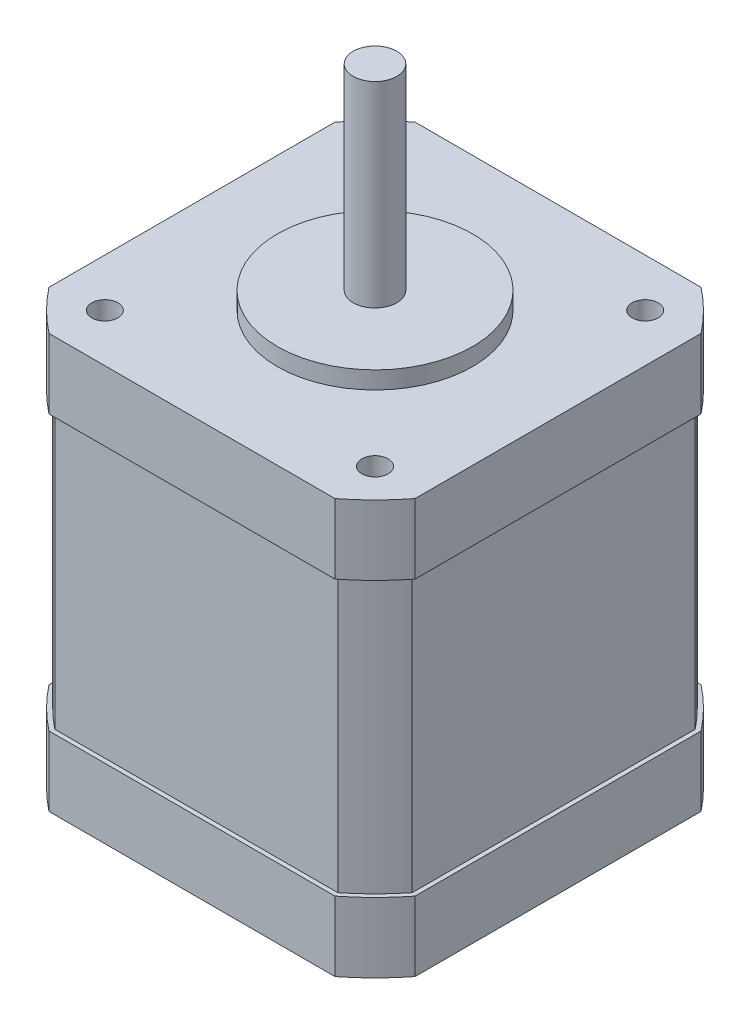
ISO-10303-21;
HEADER;
FILE_DESCRIPTION(('STEP AP214'),'2;1');
FILE_NAME('part.step','',(''),(''),'','','');
FILE_SCHEMA(('AUTOMOTIVE_DESIGN { 1 0 10303 214 1 1 1 1 }'));
ENDSEC;
DATA;
#1=APPLICATION_CONTEXT('core data for automotive mechanical design processes');
#2=APPLICATION_PROTOCOL_DEFINITION('international standard','automotive_design',2000,#1);
#3=PRODUCT_CONTEXT('',#1,'mechanical');
#4=PRODUCT('Part','Part','',(#3));
#5=PRODUCT_RELATED_PRODUCT_CATEGORY('part','',(#4));
#6=PRODUCT_DEFINITION_FORMATION('','',#4);
#7=PRODUCT_DEFINITION_CONTEXT('part definition',#1,'design');
#8=PRODUCT_DEFINITION('design','',#6,#7);
#9=PRODUCT_DEFINITION_SHAPE('','',#8);
#10=(LENGTH_UNIT() NAMED_UNIT(*) SI_UNIT(.MILLI.,.METRE.));
#11=(NAMED_UNIT(*) PLANE_ANGLE_UNIT() SI_UNIT($,.RADIAN.));
#12=(NAMED_UNIT(*) SI_UNIT($,.STERADIAN.) SOLID_ANGLE_UNIT());
#13=UNCERTAINTY_MEASURE_WITH_UNIT(LENGTH_MEASURE(1.E-05),#10,'distance_accuracy_value','');
#14=(GEOMETRIC_REPRESENTATION_CONTEXT(3) GLOBAL_UNCERTAINTY_ASSIGNED_CONTEXT((#13)) GLOBAL_UNIT_ASSIGNED_CONTEXT((#10,
#11,#12)) REPRESENTATION_CONTEXT('',''));
#15=CARTESIAN_POINT('',(0.,0.,0.));
#16=DIRECTION('',(0.,0.,1.));
#17=DIRECTION('',(1.,0.,0.));
#18=AXIS2_PLACEMENT_3D('',#15,#16,#17);
#19=CARTESIAN_POINT('',(0.,47.5,0.));
#20=DIRECTION('',(0.,-1.,0.));
#21=DIRECTION('',(0.,0.,-1.));
#22=AXIS2_PLACEMENT_3D('',#19,#20,#21);
#23=CYLINDRICAL_SURFACE('',#22,26.65);
#24=DIRECTION('',(0.,-1.,0.));
#25=VECTOR('',#24,1.);
#26=CARTESIAN_POINT('',(-16.4080010970258,47.5,-21.));
#27=LINE('',#26,#25);
#28=CARTESIAN_POINT('',(-16.4080010970258,47.5,-21.));
#29=VERTEX_POINT('',#28);
#30=CARTESIAN_POINT('',(-16.4080010970258,39.5,-21.));
#31=VERTEX_POINT('',#30);
#32=EDGE_CURVE('E363',#29,#31,#27,.T.);
#33=ORIENTED_EDGE('',*,*,#32,.T.);
#34=CARTESIAN_POINT('',(0.,39.5,0.));
#35=DIRECTION('',(0.,1.,0.));
#36=DIRECTION('',(0.,0.,1.));
#37=AXIS2_PLACEMENT_3D('',#34,#35,#36);
#38=CIRCLE('',#37,26.65);
#39=CARTESIAN_POINT('',(-21.,39.5,-16.4080010970258));
#40=VERTEX_POINT('',#39);
#41=EDGE_CURVE('E58',#31,#40,#38,.T.);
#42=ORIENTED_EDGE('',*,*,#41,.T.);
#43=DIRECTION('',(0.,-1.,0.));
#44=VECTOR('',#43,1.);
#45=CARTESIAN_POINT('',(-21.,47.5,-16.4080010970258));
#46=LINE('',#45,#44);
#47=CARTESIAN_POINT('',(-21.,47.5,-16.4080010970258));
#48=VERTEX_POINT('',#47);
#49=EDGE_CURVE('E297',#48,#40,#46,.T.);
#50=ORIENTED_EDGE('',*,*,#49,.F.);
#51=CARTESIAN_POINT('',(0.,47.5,0.));
#52=DIRECTION('',(0.,1.,0.));
#53=DIRECTION('',(0.,0.,1.));
#54=AXIS2_PLACEMENT_3D('',#51,#52,#53);
#55=CIRCLE('',#54,26.65);
#56=EDGE_CURVE('E322',#29,#48,#55,.T.);
#57=ORIENTED_EDGE('',*,*,#56,.F.);
#58=EDGE_LOOP('',(#33,#42,#50,#57));
#59=FACE_BOUND('',#58,.T.);
#60=ADVANCED_FACE('F36',(#59),#23,.T.);
#61=CARTESIAN_POINT('',(-21.,47.5,-16.4080010970258));
#62=DIRECTION('',(1.,0.,0.));
#63=DIRECTION('',(0.,0.,-1.));
#64=AXIS2_PLACEMENT_3D('',#61,#62,#63);
#65=PLANE('',#64);
#66=ORIENTED_EDGE('',*,*,#49,.T.);
#67=DIRECTION('',(0.,0.,1.));
#68=VECTOR('',#67,1.);
#69=CARTESIAN_POINT('',(-21.,39.5,-16.4080010970258));
#70=LINE('',#69,#68);
#71=CARTESIAN_POINT('',(-21.,39.5,16.4080010970258));
#72=VERTEX_POINT('',#71);
#73=EDGE_CURVE('E280',#40,#72,#70,.T.);
#74=ORIENTED_EDGE('',*,*,#73,.T.);
#75=DIRECTION('',(0.,-1.,0.));
#76=VECTOR('',#75,1.);
#77=CARTESIAN_POINT('',(-21.,47.5,16.4080010970258));
#78=LINE('',#77,#76);
#79=CARTESIAN_POINT('',(-21.,47.5,16.4080010970258));
#80=VERTEX_POINT('',#79);
#81=EDGE_CURVE('E387',#80,#72,#78,.T.);
#82=ORIENTED_EDGE('',*,*,#81,.F.);
#83=DIRECTION('',(0.,0.,1.));
#84=VECTOR('',#83,1.);
#85=CARTESIAN_POINT('',(-21.,47.5,-16.4080010970258));
#86=LINE('',#85,#84);
#87=EDGE_CURVE('E325',#48,#80,#86,.T.);
#88=ORIENTED_EDGE('',*,*,#87,.F.);
#89=EDGE_LOOP('',(#66,#74,#82,#88));
#90=FACE_BOUND('',#89,.T.);
#91=ADVANCED_FACE('F447',(#90),#65,.F.);
#92=CARTESIAN_POINT('',(0.,47.5,0.));
#93=DIRECTION('',(0.,-1.,0.));
#94=DIRECTION('',(0.,0.,-1.));
#95=AXIS2_PLACEMENT_3D('',#92,#93,#94);
#96=CYLINDRICAL_SURFACE('',#95,26.65);
#97=ORIENTED_EDGE('',*,*,#81,.T.);
#98=CARTESIAN_POINT('',(0.,39.5,0.));
#99=DIRECTION('',(0.,1.,0.));
#100=DIRECTION('',(0.,0.,1.));
#101=AXIS2_PLACEMENT_3D('',#98,#99,#100);
#102=CIRCLE('',#101,26.65);
#103=CARTESIAN_POINT('',(-16.4080010970258,39.5,21.));
#104=VERTEX_POINT('',#103);
#105=EDGE_CURVE('E277',#72,#104,#102,.T.);
#106=ORIENTED_EDGE('',*,*,#105,.T.);
#107=DIRECTION('',(0.,-1.,0.));
#108=VECTOR('',#107,1.);
#109=CARTESIAN_POINT('',(-16.4080010970258,47.5,21.));
#110=LINE('',#109,#108);
#111=CARTESIAN_POINT('',(-16.4080010970258,47.5,21.));
#112=VERTEX_POINT('',#111);
#113=EDGE_CURVE('E383',#112,#104,#110,.T.);
#114=ORIENTED_EDGE('',*,*,#113,.F.);
#115=CARTESIAN_POINT('',(0.,47.5,0.));
#116=DIRECTION('',(0.,1.,0.));
#117=DIRECTION('',(0.,0.,1.));
#118=AXIS2_PLACEMENT_3D('',#115,#116,#117);
#119=CIRCLE('',#118,26.65);
#120=EDGE_CURVE('E328',#80,#112,#119,.T.);
#121=ORIENTED_EDGE('',*,*,#120,.F.);
#122=EDGE_LOOP('',(#97,#106,#114,#121));
#123=FACE_BOUND('',#122,.T.);
#124=ADVANCED_FACE('F452',(#123),#96,.T.);
#125=CARTESIAN_POINT('',(-16.4080010970258,47.5,21.));
#126=DIRECTION('',(0.,0.,-1.));
#127=DIRECTION('',(-1.,0.,0.));
#128=AXIS2_PLACEMENT_3D('',#125,#126,#127);
#129=PLANE('',#128);
#130=ORIENTED_EDGE('',*,*,#113,.T.);
#131=DIRECTION('',(1.,0.,0.));
#132=VECTOR('',#131,1.);
#133=CARTESIAN_POINT('',(-16.4080010970258,39.5,21.));
#134=LINE('',#133,#132);
#135=CARTESIAN_POINT('',(16.4080010970258,39.5,21.));
#136=VERTEX_POINT('',#135);
#137=EDGE_CURVE('E274',#104,#136,#134,.T.);
#138=ORIENTED_EDGE('',*,*,#137,.T.);
#139=DIRECTION('',(0.,-1.,0.));
#140=VECTOR('',#139,1.);
#141=CARTESIAN_POINT('',(16.4080010970258,47.5,21.));
#142=LINE('',#141,#140);
#143=CARTESIAN_POINT('',(16.4080010970258,47.5,21.));
#144=VERTEX_POINT('',#143);
#145=EDGE_CURVE('E379',#144,#136,#142,.T.);
#146=ORIENTED_EDGE('',*,*,#145,.F.);
#147=DIRECTION('',(1.,0.,0.));
#148=VECTOR('',#147,1.);
#149=CARTESIAN_POINT('',(-16.4080010970258,47.5,21.));
#150=LINE('',#149,#148);
#151=EDGE_CURVE('E330',#112,#144,#150,.T.);
#152=ORIENTED_EDGE('',*,*,#151,.F.);
#153=EDGE_LOOP('',(#130,#138,#146,#152));
#154=FACE_BOUND('',#153,.T.);
#155=ADVANCED_FACE('F464',(#154),#129,.F.);
#156=CARTESIAN_POINT('',(0.,47.5,0.));
#157=DIRECTION('',(0.,-1.,0.));
#158=DIRECTION('',(0.,0.,-1.));
#159=AXIS2_PLACEMENT_3D('',#156,#157,#158);
#160=CYLINDRICAL_SURFACE('',#159,26.65);
#161=ORIENTED_EDGE('',*,*,#145,.T.);
#162=CARTESIAN_POINT('',(0.,39.5,0.));
#163=DIRECTION('',(0.,1.,0.));
#164=DIRECTION('',(0.,0.,1.));
#165=AXIS2_PLACEMENT_3D('',#162,#163,#164);
#166=CIRCLE('',#165,26.65);
#167=CARTESIAN_POINT('',(21.,39.5,16.4080010970258));
#168=VERTEX_POINT('',#167);
#169=EDGE_CURVE('E271',#136,#168,#166,.T.);
#170=ORIENTED_EDGE('',*,*,#169,.T.);
#171=DIRECTION('',(0.,-1.,0.));
#172=VECTOR('',#171,1.);
#173=CARTESIAN_POINT('',(21.,47.5,16.4080010970258));
#174=LINE('',#173,#172);
#175=CARTESIAN_POINT('',(21.,47.5,16.4080010970258));
#176=VERTEX_POINT('',#175);
#177=EDGE_CURVE('E375',#176,#168,#174,.T.);
#178=ORIENTED_EDGE('',*,*,#177,.F.);
#179=CARTESIAN_POINT('',(0.,47.5,0.));
#180=DIRECTION('',(0.,1.,0.));
#181=DIRECTION('',(0.,0.,1.));
#182=AXIS2_PLACEMENT_3D('',#179,#180,#181);
#183=CIRCLE('',#182,26.65);
#184=EDGE_CURVE('E332',#144,#176,#183,.T.);
#185=ORIENTED_EDGE('',*,*,#184,.F.);
#186=EDGE_LOOP('',(#161,#170,#178,#185));
#187=FACE_BOUND('',#186,.T.);
#188=ADVANCED_FACE('F468',(#187),#160,.T.);
#189=CARTESIAN_POINT('',(21.,47.5,-16.4080010970258));
#190=DIRECTION('',(-1.,0.,0.));
#191=DIRECTION('',(0.,0.,1.));
#192=AXIS2_PLACEMENT_3D('',#189,#190,#191);
#193=PLANE('',#192);
#194=ORIENTED_EDGE('',*,*,#177,.T.);
#195=DIRECTION('',(0.,0.,-1.));
#196=VECTOR('',#195,1.);
#197=CARTESIAN_POINT('',(21.,39.5,-16.4080010970258));
#198=LINE('',#197,#196);
#199=CARTESIAN_POINT('',(21.,39.5,-16.4080010970258));
#200=VERTEX_POINT('',#199);
#201=EDGE_CURVE('E268',#168,#200,#198,.T.);
#202=ORIENTED_EDGE('',*,*,#201,.T.);
#203=DIRECTION('',(0.,-1.,0.));
#204=VECTOR('',#203,1.);
#205=CARTESIAN_POINT('',(21.,47.5,-16.4080010970258));
#206=LINE('',#205,#204);
#207=CARTESIAN_POINT('',(21.,47.5,-16.4080010970258));
#208=VERTEX_POINT('',#207);
#209=EDGE_CURVE('E371',#208,#200,#206,.T.);
#210=ORIENTED_EDGE('',*,*,#209,.F.);
#211=DIRECTION('',(0.,0.,-1.));
#212=VECTOR('',#211,1.);
#213=CARTESIAN_POINT('',(21.,47.5,-16.4080010970258));
#214=LINE('',#213,#212);
#215=EDGE_CURVE('E334',#176,#208,#214,.T.);
#216=ORIENTED_EDGE('',*,*,#215,.F.);
#217=EDGE_LOOP('',(#194,#202,#210,#216));
#218=FACE_BOUND('',#217,.T.);
#219=ADVANCED_FACE('F441',(#218),#193,.F.);
#220=CARTESIAN_POINT('',(0.,47.5,0.));
#221=DIRECTION('',(0.,-1.,0.));
#222=DIRECTION('',(0.,0.,-1.));
#223=AXIS2_PLACEMENT_3D('',#220,#221,#222);
#224=CYLINDRICAL_SURFACE('',#223,26.65);
#225=ORIENTED_EDGE('',*,*,#209,.T.);
#226=CARTESIAN_POINT('',(0.,39.5,0.));
#227=DIRECTION('',(0.,1.,0.));
#228=DIRECTION('',(0.,0.,1.));
#229=AXIS2_PLACEMENT_3D('',#226,#227,#228);
#230=CIRCLE('',#229,26.65);
#231=CARTESIAN_POINT('',(16.4080010970258,39.5,-21.));
#232=VERTEX_POINT('',#231);
#233=EDGE_CURVE('E265',#200,#232,#230,.T.);
#234=ORIENTED_EDGE('',*,*,#233,.T.);
#235=DIRECTION('',(0.,-1.,0.));
#236=VECTOR('',#235,1.);
#237=CARTESIAN_POINT('',(16.4080010970258,47.5,-21.));
#238=LINE('',#237,#236);
#239=CARTESIAN_POINT('',(16.4080010970258,47.5,-21.));
#240=VERTEX_POINT('',#239);
#241=EDGE_CURVE('E367',#240,#232,#238,.T.);
#242=ORIENTED_EDGE('',*,*,#241,.F.);
#243=CARTESIAN_POINT('',(0.,47.5,0.));
#244=DIRECTION('',(0.,1.,0.));
#245=DIRECTION('',(0.,0.,1.));
#246=AXIS2_PLACEMENT_3D('',#243,#244,#245);
#247=CIRCLE('',#246,26.65);
#248=EDGE_CURVE('E336',#208,#240,#247,.T.);
#249=ORIENTED_EDGE('',*,*,#248,.F.);
#250=EDGE_LOOP('',(#225,#234,#242,#249));
#251=FACE_BOUND('',#250,.T.);
#252=ADVANCED_FACE('F435',(#251),#224,.T.);
#253=CARTESIAN_POINT('',(-16.4080010970258,47.5,-21.));
#254=DIRECTION('',(0.,0.,1.));
#255=DIRECTION('',(1.,0.,0.));
#256=AXIS2_PLACEMENT_3D('',#253,#254,#255);
#257=PLANE('',#256);
#258=ORIENTED_EDGE('',*,*,#241,.T.);
#259=DIRECTION('',(-1.,0.,0.));
#260=VECTOR('',#259,1.);
#261=CARTESIAN_POINT('',(-16.4080010970258,39.5,-21.));
#262=LINE('',#261,#260);
#263=EDGE_CURVE('E13',#232,#31,#262,.T.);
#264=ORIENTED_EDGE('',*,*,#263,.T.);
#265=ORIENTED_EDGE('',*,*,#32,.F.);
#266=DIRECTION('',(-1.,0.,0.));
#267=VECTOR('',#266,1.);
#268=CARTESIAN_POINT('',(-16.4080010970258,47.5,-21.));
#269=LINE('',#268,#267);
#270=EDGE_CURVE('E338',#240,#29,#269,.T.);
#271=ORIENTED_EDGE('',*,*,#270,.F.);
#272=EDGE_LOOP('',(#258,#264,#265,#271));
#273=FACE_BOUND('',#272,.T.);
#274=ADVANCED_FACE('F443',(#273),#257,.F.);
#275=CARTESIAN_POINT('',(0.,47.5,0.));
#276=DIRECTION('',(0.,1.,0.));
#277=DIRECTION('',(0.,0.,1.));
#278=AXIS2_PLACEMENT_3D('',#275,#276,#277);
#279=PLANE('',#278);
#280=CARTESIAN_POINT('',(0.,47.5,0.));
#281=DIRECTION('',(0.,1.,0.));
#282=DIRECTION('',(0.,0.,1.));
#283=AXIS2_PLACEMENT_3D('',#280,#281,#282);
#284=CIRCLE('',#283,11.2);
#285=CARTESIAN_POINT('',(0.,47.5,11.2));
#286=VERTEX_POINT('',#285);
#287=EDGE_CURVE('E291',#286,#286,#284,.T.);
#288=ORIENTED_EDGE('',*,*,#287,.F.);
#289=EDGE_LOOP('',(#288));
#290=FACE_BOUND('',#289,.T.);
#291=CARTESIAN_POINT('',(15.4997806436091,47.5,15.4997806436091));
#292=DIRECTION('',(0.,1.,0.));
#293=DIRECTION('',(0.,0.,1.));
#294=AXIS2_PLACEMENT_3D('',#291,#292,#293);
#295=CIRCLE('',#294,1.5);
#296=CARTESIAN_POINT('',(15.4997806436091,47.5,16.9997806436091));
#297=VERTEX_POINT('',#296);
#298=EDGE_CURVE('E308',#297,#297,#295,.T.);
#299=ORIENTED_EDGE('',*,*,#298,.F.);
#300=EDGE_LOOP('',(#299));
#301=FACE_BOUND('',#300,.T.);
#302=CARTESIAN_POINT('',(-15.4997806436091,47.5,-15.4997806436091));
#303=DIRECTION('',(0.,1.,0.));
#304=DIRECTION('',(0.,0.,1.));
#305=AXIS2_PLACEMENT_3D('',#302,#303,#304);
#306=CIRCLE('',#305,1.5);
#307=CARTESIAN_POINT('',(-15.4997806436091,47.5,-13.9997806436091));
#308=VERTEX_POINT('',#307);
#309=EDGE_CURVE('E301',#308,#308,#306,.T.);
#310=ORIENTED_EDGE('',*,*,#309,.F.);
#311=EDGE_LOOP('',(#310));
#312=FACE_BOUND('',#311,.T.);
#313=CARTESIAN_POINT('',(15.4997806436091,47.5,-15.4997806436091));
#314=DIRECTION('',(0.,1.,0.));
#315=DIRECTION('',(0.,0.,1.));
#316=AXIS2_PLACEMENT_3D('',#313,#314,#315);
#317=CIRCLE('',#316,1.5);
#318=CARTESIAN_POINT('',(15.4997806436091,47.5,-13.9997806436091));
#319=VERTEX_POINT('',#318);
#320=EDGE_CURVE('E294',#319,#319,#317,.T.);
#321=ORIENTED_EDGE('',*,*,#320,.F.);
#322=EDGE_LOOP('',(#321));
#323=FACE_BOUND('',#322,.T.);
#324=CARTESIAN_POINT('',(-15.4997806436091,47.5,15.4997806436091));
#325=DIRECTION('',(0.,1.,0.));
#326=DIRECTION('',(0.,0.,1.));
#327=AXIS2_PLACEMENT_3D('',#324,#325,#326);
#328=CIRCLE('',#327,1.5);
#329=CARTESIAN_POINT('',(-15.4997806436091,47.5,16.9997806436091));
#330=VERTEX_POINT('',#329);
#331=EDGE_CURVE('E307',#330,#330,#328,.T.);
#332=ORIENTED_EDGE('',*,*,#331,.F.);
#333=EDGE_LOOP('',(#332));
#334=FACE_BOUND('',#333,.T.);
#335=ORIENTED_EDGE('',*,*,#56,.T.);
#336=ORIENTED_EDGE('',*,*,#87,.T.);
#337=ORIENTED_EDGE('',*,*,#120,.T.);
#338=ORIENTED_EDGE('',*,*,#151,.T.);
#339=ORIENTED_EDGE('',*,*,#184,.T.);
#340=ORIENTED_EDGE('',*,*,#215,.T.);
#341=ORIENTED_EDGE('',*,*,#248,.T.);
#342=ORIENTED_EDGE('',*,*,#270,.T.);
#343=EDGE_LOOP('',(#335,#336,#337,#338,#339,#340,#341,#342));
#344=FACE_BOUND('',#343,.T.);
#345=ADVANCED_FACE('F493',(#290,#301,#312,#323,#334,#344),#279,.T.);
#346=CARTESIAN_POINT('',(-15.4997806436091,39.5,15.4997806436091));
#347=DIRECTION('',(0.,1.,0.));
#348=DIRECTION('',(0.,0.,1.));
#349=AXIS2_PLACEMENT_3D('',#346,#347,#348);
#350=CYLINDRICAL_SURFACE('',#349,1.5);
#351=CARTESIAN_POINT('',(-15.4997806436091,39.5,15.4997806436091));
#352=DIRECTION('',(0.,1.,0.));
#353=DIRECTION('',(0.,0.,1.));
#354=AXIS2_PLACEMENT_3D('',#351,#352,#353);
#355=CIRCLE('',#354,1.5);
#356=CARTESIAN_POINT('',(-15.4997806436091,39.5,16.9997806436091));
#357=VERTEX_POINT('',#356);
#358=EDGE_CURVE('E316',#357,#357,#355,.T.);
#359=ORIENTED_EDGE('',*,*,#358,.F.);
#360=EDGE_LOOP('',(#359));
#361=FACE_BOUND('',#360,.T.);
#362=ORIENTED_EDGE('',*,*,#331,.T.);
#363=EDGE_LOOP('',(#362));
#364=FACE_BOUND('',#363,.T.);
#365=ADVANCED_FACE('F495',(#361,#364),#350,.F.);
#366=CARTESIAN_POINT('',(-15.4997806436091,39.5,15.4997806436091));
#367=DIRECTION('',(0.,1.,0.));
#368=DIRECTION('',(0.,0.,1.));
#369=AXIS2_PLACEMENT_3D('',#366,#367,#368);
#370=PLANE('',#369);
#371=ORIENTED_EDGE('',*,*,#358,.T.);
#372=EDGE_LOOP('',(#371));
#373=FACE_BOUND('',#372,.T.);
#374=ADVANCED_FACE('F502',(#373),#370,.T.);
#375=CARTESIAN_POINT('',(15.4997806436091,39.5,-15.4997806436091));
#376=DIRECTION('',(0.,1.,0.));
#377=DIRECTION('',(0.,0.,1.));
#378=AXIS2_PLACEMENT_3D('',#375,#376,#377);
#379=CYLINDRICAL_SURFACE('',#378,1.5);
#380=CARTESIAN_POINT('',(15.4997806436091,39.5,-15.4997806436091));
#381=DIRECTION('',(0.,1.,0.));
#382=DIRECTION('',(0.,0.,1.));
#383=AXIS2_PLACEMENT_3D('',#380,#381,#382);
#384=CIRCLE('',#383,1.5);
#385=CARTESIAN_POINT('',(15.4997806436091,39.5,-13.9997806436091));
#386=VERTEX_POINT('',#385);
#387=EDGE_CURVE('E298',#386,#386,#384,.T.);
#388=ORIENTED_EDGE('',*,*,#387,.F.);
#389=EDGE_LOOP('',(#388));
#390=FACE_BOUND('',#389,.T.);
#391=ORIENTED_EDGE('',*,*,#320,.T.);
#392=EDGE_LOOP('',(#391));
#393=FACE_BOUND('',#392,.T.);
#394=ADVANCED_FACE('F549',(#390,#393),#379,.F.);
#395=CARTESIAN_POINT('',(15.4997806436091,39.5,-15.4997806436091));
#396=DIRECTION('',(0.,1.,0.));
#397=DIRECTION('',(0.,0.,1.));
#398=AXIS2_PLACEMENT_3D('',#395,#396,#397);
#399=PLANE('',#398);
#400=ORIENTED_EDGE('',*,*,#387,.T.);
#401=EDGE_LOOP('',(#400));
#402=FACE_BOUND('',#401,.T.);
#403=ADVANCED_FACE('F545',(#402),#399,.T.);
#404=CARTESIAN_POINT('',(-15.4997806436091,39.5,-15.4997806436091));
#405=DIRECTION('',(0.,1.,0.));
#406=DIRECTION('',(0.,0.,1.));
#407=AXIS2_PLACEMENT_3D('',#404,#405,#406);
#408=CYLINDRICAL_SURFACE('',#407,1.5);
#409=CARTESIAN_POINT('',(-15.4997806436091,39.5,-15.4997806436091));
#410=DIRECTION('',(0.,1.,0.));
#411=DIRECTION('',(0.,0.,1.));
#412=AXIS2_PLACEMENT_3D('',#409,#410,#411);
#413=CIRCLE('',#412,1.5);
#414=CARTESIAN_POINT('',(-15.4997806436091,39.5,-13.9997806436091));
#415=VERTEX_POINT('',#414);
#416=EDGE_CURVE('E311',#415,#415,#413,.T.);
#417=ORIENTED_EDGE('',*,*,#416,.F.);
#418=EDGE_LOOP('',(#417));
#419=FACE_BOUND('',#418,.T.);
#420=ORIENTED_EDGE('',*,*,#309,.T.);
#421=EDGE_LOOP('',(#420));
#422=FACE_BOUND('',#421,.T.);
#423=ADVANCED_FACE('F548',(#419,#422),#408,.F.);
#424=CARTESIAN_POINT('',(-15.4997806436091,39.5,-15.4997806436091));
#425=DIRECTION('',(0.,1.,0.));
#426=DIRECTION('',(0.,0.,1.));
#427=AXIS2_PLACEMENT_3D('',#424,#425,#426);
#428=PLANE('',#427);
#429=ORIENTED_EDGE('',*,*,#416,.T.);
#430=EDGE_LOOP('',(#429));
#431=FACE_BOUND('',#430,.T.);
#432=ADVANCED_FACE('F560',(#431),#428,.T.);
#433=CARTESIAN_POINT('',(15.4997806436091,39.5,15.4997806436091));
#434=DIRECTION('',(0.,1.,0.));
#435=DIRECTION('',(0.,0.,1.));
#436=AXIS2_PLACEMENT_3D('',#433,#434,#435);
#437=CYLINDRICAL_SURFACE('',#436,1.5);
#438=CARTESIAN_POINT('',(15.4997806436091,39.5,15.4997806436091));
#439=DIRECTION('',(0.,1.,0.));
#440=DIRECTION('',(0.,0.,1.));
#441=AXIS2_PLACEMENT_3D('',#438,#439,#440);
#442=CIRCLE('',#441,1.5);
#443=CARTESIAN_POINT('',(15.4997806436091,39.5,16.9997806436091));
#444=VERTEX_POINT('',#443);
#445=EDGE_CURVE('E304',#444,#444,#442,.T.);
#446=ORIENTED_EDGE('',*,*,#445,.F.);
#447=EDGE_LOOP('',(#446));
#448=FACE_BOUND('',#447,.T.);
#449=ORIENTED_EDGE('',*,*,#298,.T.);
#450=EDGE_LOOP('',(#449));
#451=FACE_BOUND('',#450,.T.);
#452=ADVANCED_FACE('F556',(#448,#451),#437,.F.);
#453=CARTESIAN_POINT('',(15.4997806436091,39.5,15.4997806436091));
#454=DIRECTION('',(0.,1.,0.));
#455=DIRECTION('',(0.,0.,1.));
#456=AXIS2_PLACEMENT_3D('',#453,#454,#455);
#457=PLANE('',#456);
#458=ORIENTED_EDGE('',*,*,#445,.T.);
#459=EDGE_LOOP('',(#458));
#460=FACE_BOUND('',#459,.T.);
#461=ADVANCED_FACE('F543',(#460),#457,.T.);
#462=CARTESIAN_POINT('',(0.,49.5,0.));
#463=DIRECTION('',(0.,-1.,0.));
#464=DIRECTION('',(0.,0.,-1.));
#465=AXIS2_PLACEMENT_3D('',#462,#463,#464);
#466=CYLINDRICAL_SURFACE('',#465,11.2);
#467=CARTESIAN_POINT('',(0.,49.5,0.));
#468=DIRECTION('',(0.,1.,0.));
#469=DIRECTION('',(0.,0.,1.));
#470=AXIS2_PLACEMENT_3D('',#467,#468,#469);
#471=CIRCLE('',#470,11.2);
#472=CARTESIAN_POINT('',(0.,49.5,11.2));
#473=VERTEX_POINT('',#472);
#474=EDGE_CURVE('E287',#473,#473,#471,.T.);
#475=ORIENTED_EDGE('',*,*,#474,.F.);
#476=EDGE_LOOP('',(#475));
#477=FACE_BOUND('',#476,.T.);
#478=ORIENTED_EDGE('',*,*,#287,.T.);
#479=EDGE_LOOP('',(#478));
#480=FACE_BOUND('',#479,.T.);
#481=ADVANCED_FACE('F539',(#477,#480),#466,.T.);
#482=CARTESIAN_POINT('',(0.,49.5,0.));
#483=DIRECTION('',(0.,1.,0.));
#484=DIRECTION('',(0.,0.,1.));
#485=AXIS2_PLACEMENT_3D('',#482,#483,#484);
#486=PLANE('',#485);
#487=CARTESIAN_POINT('',(0.,49.5,0.));
#488=DIRECTION('',(0.,1.,0.));
#489=DIRECTION('',(0.,0.,1.));
#490=AXIS2_PLACEMENT_3D('',#487,#488,#489);
#491=CIRCLE('',#490,2.5);
#492=CARTESIAN_POINT('',(0.,49.5,2.5));
#493=VERTEX_POINT('',#492);
#494=EDGE_CURVE('E288',#493,#493,#491,.T.);
#495=ORIENTED_EDGE('',*,*,#494,.F.);
#496=EDGE_LOOP('',(#495));
#497=FACE_BOUND('',#496,.T.);
#498=ORIENTED_EDGE('',*,*,#474,.T.);
#499=EDGE_LOOP('',(#498));
#500=FACE_BOUND('',#499,.T.);
#501=ADVANCED_FACE('F535',(#497,#500),#486,.T.);
#502=CARTESIAN_POINT('',(0.,72.,0.));
#503=DIRECTION('',(0.,-1.,0.));
#504=DIRECTION('',(0.,0.,-1.));
#505=AXIS2_PLACEMENT_3D('',#502,#503,#504);
#506=CYLINDRICAL_SURFACE('',#505,2.5);
#507=CARTESIAN_POINT('',(0.,72.,0.));
#508=DIRECTION('',(0.,1.,0.));
#509=DIRECTION('',(0.,0.,1.));
#510=AXIS2_PLACEMENT_3D('',#507,#508,#509);
#511=CIRCLE('',#510,2.5);
#512=CARTESIAN_POINT('',(0.,72.,2.5));
#513=VERTEX_POINT('',#512);
#514=EDGE_CURVE('E284',#513,#513,#511,.T.);
#515=ORIENTED_EDGE('',*,*,#514,.F.);
#516=EDGE_LOOP('',(#515));
#517=FACE_BOUND('',#516,.T.);
#518=ORIENTED_EDGE('',*,*,#494,.T.);
#519=EDGE_LOOP('',(#518));
#520=FACE_BOUND('',#519,.T.);
#521=ADVANCED_FACE('F531',(#517,#520),#506,.T.);
#522=CARTESIAN_POINT('',(0.,72.,0.));
#523=DIRECTION('',(0.,1.,0.));
#524=DIRECTION('',(0.,0.,1.));
#525=AXIS2_PLACEMENT_3D('',#522,#523,#524);
#526=PLANE('',#525);
#527=ORIENTED_EDGE('',*,*,#514,.T.);
#528=EDGE_LOOP('',(#527));
#529=FACE_BOUND('',#528,.T.);
#530=ADVANCED_FACE('F528',(#529),#526,.T.);
#531=CARTESIAN_POINT('',(0.,39.5,0.));
#532=DIRECTION('',(0.,1.,0.));
#533=DIRECTION('',(0.,0.,1.));
#534=AXIS2_PLACEMENT_3D('',#531,#532,#533);
#535=PLANE('',#534);
#536=CARTESIAN_POINT('',(0.,39.5,0.));
#537=DIRECTION('',(0.,1.,0.));
#538=DIRECTION('',(0.,0.,1.));
#539=AXIS2_PLACEMENT_3D('',#536,#537,#538);
#540=CIRCLE('',#539,26.15);
#541=CARTESIAN_POINT('',(-16.2349160761613,39.5,-20.5));
#542=VERTEX_POINT('',#541);
#543=CARTESIAN_POINT('',(-20.5,39.5,-16.2349160761613));
#544=VERTEX_POINT('',#543);
#545=EDGE_CURVE('E217',#542,#544,#540,.T.);
#546=ORIENTED_EDGE('',*,*,#545,.T.);
#547=DIRECTION('',(0.,0.,1.));
#548=VECTOR('',#547,1.);
#549=CARTESIAN_POINT('',(-20.5,39.5,-16.2349160761613));
#550=LINE('',#549,#548);
#551=CARTESIAN_POINT('',(-20.5,39.5,16.2349160761613));
#552=VERTEX_POINT('',#551);
#553=EDGE_CURVE('E199',#544,#552,#550,.T.);
#554=ORIENTED_EDGE('',*,*,#553,.T.);
#555=CARTESIAN_POINT('',(0.,39.5,0.));
#556=DIRECTION('',(0.,1.,0.));
#557=DIRECTION('',(0.,0.,1.));
#558=AXIS2_PLACEMENT_3D('',#555,#556,#557);
#559=CIRCLE('',#558,26.15);
#560=CARTESIAN_POINT('',(-16.2349160761613,39.5,20.5));
#561=VERTEX_POINT('',#560);
#562=EDGE_CURVE('E213',#552,#561,#559,.T.);
#563=ORIENTED_EDGE('',*,*,#562,.T.);
#564=DIRECTION('',(1.,0.,0.));
#565=VECTOR('',#564,1.);
#566=CARTESIAN_POINT('',(-16.2349160761613,39.5,20.5));
#567=LINE('',#566,#565);
#568=CARTESIAN_POINT('',(16.2349160761613,39.5,20.5));
#569=VERTEX_POINT('',#568);
#570=EDGE_CURVE('E221',#561,#569,#567,.T.);
#571=ORIENTED_EDGE('',*,*,#570,.T.);
#572=CARTESIAN_POINT('',(0.,39.5,0.));
#573=DIRECTION('',(0.,1.,0.));
#574=DIRECTION('',(0.,0.,1.));
#575=AXIS2_PLACEMENT_3D('',#572,#573,#574);
#576=CIRCLE('',#575,26.15);
#577=CARTESIAN_POINT('',(20.5,39.5,16.2349160761613));
#578=VERTEX_POINT('',#577);
#579=EDGE_CURVE('E223',#569,#578,#576,.T.);
#580=ORIENTED_EDGE('',*,*,#579,.T.);
#581=DIRECTION('',(0.,0.,-1.));
#582=VECTOR('',#581,1.);
#583=CARTESIAN_POINT('',(20.5,39.5,16.2349160761613));
#584=LINE('',#583,#582);
#585=CARTESIAN_POINT('',(20.5,39.5,-16.2349160761613));
#586=VERTEX_POINT('',#585);
#587=EDGE_CURVE('E229',#578,#586,#584,.T.);
#588=ORIENTED_EDGE('',*,*,#587,.T.);
#589=CARTESIAN_POINT('',(0.,39.5,0.));
#590=DIRECTION('',(0.,1.,0.));
#591=DIRECTION('',(0.,0.,1.));
#592=AXIS2_PLACEMENT_3D('',#589,#590,#591);
#593=CIRCLE('',#592,26.15);
#594=CARTESIAN_POINT('',(16.2349160761613,39.5,-20.5));
#595=VERTEX_POINT('',#594);
#596=EDGE_CURVE('E232',#586,#595,#593,.T.);
#597=ORIENTED_EDGE('',*,*,#596,.T.);
#598=DIRECTION('',(-1.,0.,0.));
#599=VECTOR('',#598,1.);
#600=CARTESIAN_POINT('',(16.2349160761613,39.5,-20.5));
#601=LINE('',#600,#599);
#602=EDGE_CURVE('E235',#595,#542,#601,.T.);
#603=ORIENTED_EDGE('',*,*,#602,.T.);
#604=EDGE_LOOP('',(#546,#554,#563,#571,#580,#588,#597,#603));
#605=FACE_BOUND('',#604,.T.);
#606=ORIENTED_EDGE('',*,*,#263,.F.);
#607=ORIENTED_EDGE('',*,*,#233,.F.);
#608=ORIENTED_EDGE('',*,*,#201,.F.);
#609=ORIENTED_EDGE('',*,*,#169,.F.);
#610=ORIENTED_EDGE('',*,*,#137,.F.);
#611=ORIENTED_EDGE('',*,*,#105,.F.);
#612=ORIENTED_EDGE('',*,*,#73,.F.);
#613=ORIENTED_EDGE('',*,*,#41,.F.);
#614=EDGE_LOOP('',(#606,#607,#608,#609,#610,#611,#612,#613));
#615=FACE_BOUND('',#614,.T.);
#616=ADVANCED_FACE('F211',(#605,#615),#535,.F.);
#617=CARTESIAN_POINT('',(0.,8.,0.));
#618=DIRECTION('',(0.,1.,0.));
#619=DIRECTION('',(0.,0.,1.));
#620=AXIS2_PLACEMENT_3D('',#617,#618,#619);
#621=PLANE('',#620);
#622=DIRECTION('',(0.,0.,-1.));
#623=VECTOR('',#622,1.);
#624=CARTESIAN_POINT('',(-20.5,8.,-16.2349160761613));
#625=LINE('',#624,#623);
#626=CARTESIAN_POINT('',(-20.5,8.,16.2349160761613));
#627=VERTEX_POINT('',#626);
#628=CARTESIAN_POINT('',(-20.5,8.,-16.2349160761613));
#629=VERTEX_POINT('',#628);
#630=EDGE_CURVE('E201',#627,#629,#625,.T.);
#631=ORIENTED_EDGE('',*,*,#630,.T.);
#632=CARTESIAN_POINT('',(0.,8.,0.));
#633=DIRECTION('',(0.,1.,0.));
#634=DIRECTION('',(0.,0.,1.));
#635=AXIS2_PLACEMENT_3D('',#632,#633,#634);
#636=CIRCLE('',#635,26.15);
#637=CARTESIAN_POINT('',(-16.2349160761613,8.,-20.5));
#638=VERTEX_POINT('',#637);
#639=EDGE_CURVE('E250',#629,#638,#636,.F.);
#640=ORIENTED_EDGE('',*,*,#639,.T.);
#641=DIRECTION('',(1.,0.,0.));
#642=VECTOR('',#641,1.);
#643=CARTESIAN_POINT('',(16.2349160761613,8.,-20.5));
#644=LINE('',#643,#642);
#645=CARTESIAN_POINT('',(16.2349160761613,8.,-20.5));
#646=VERTEX_POINT('',#645);
#647=EDGE_CURVE('E828',#638,#646,#644,.T.);
#648=ORIENTED_EDGE('',*,*,#647,.T.);
#649=CARTESIAN_POINT('',(0.,8.,0.));
#650=DIRECTION('',(0.,1.,0.));
#651=DIRECTION('',(0.,0.,1.));
#652=AXIS2_PLACEMENT_3D('',#649,#650,#651);
#653=CIRCLE('',#652,26.15);
#654=CARTESIAN_POINT('',(20.5,8.,-16.2349160761613));
#655=VERTEX_POINT('',#654);
#656=EDGE_CURVE('E823',#646,#655,#653,.F.);
#657=ORIENTED_EDGE('',*,*,#656,.T.);
#658=DIRECTION('',(0.,0.,1.));
#659=VECTOR('',#658,1.);
#660=CARTESIAN_POINT('',(20.5,8.,16.2349160761613));
#661=LINE('',#660,#659);
#662=CARTESIAN_POINT('',(20.5,8.,16.2349160761613));
#663=VERTEX_POINT('',#662);
#664=EDGE_CURVE('E834',#655,#663,#661,.T.);
#665=ORIENTED_EDGE('',*,*,#664,.T.);
#666=CARTESIAN_POINT('',(0.,8.,0.));
#667=DIRECTION('',(0.,1.,0.));
#668=DIRECTION('',(0.,0.,1.));
#669=AXIS2_PLACEMENT_3D('',#666,#667,#668);
#670=CIRCLE('',#669,26.15);
#671=CARTESIAN_POINT('',(16.2349160761613,8.,20.5));
#672=VERTEX_POINT('',#671);
#673=EDGE_CURVE('E837',#663,#672,#670,.F.);
#674=ORIENTED_EDGE('',*,*,#673,.T.);
#675=DIRECTION('',(-1.,0.,0.));
#676=VECTOR('',#675,1.);
#677=CARTESIAN_POINT('',(-16.2349160761613,8.,20.5));
#678=LINE('',#677,#676);
#679=CARTESIAN_POINT('',(-16.2349160761613,8.,20.5));
#680=VERTEX_POINT('',#679);
#681=EDGE_CURVE('E840',#672,#680,#678,.T.);
#682=ORIENTED_EDGE('',*,*,#681,.T.);
#683=CARTESIAN_POINT('',(0.,8.,0.));
#684=DIRECTION('',(0.,1.,0.));
#685=DIRECTION('',(0.,0.,1.));
#686=AXIS2_PLACEMENT_3D('',#683,#684,#685);
#687=CIRCLE('',#686,26.15);
#688=EDGE_CURVE('E253',#680,#627,#687,.F.);
#689=ORIENTED_EDGE('',*,*,#688,.T.);
#690=EDGE_LOOP('',(#631,#640,#648,#657,#665,#674,#682,#689));
#691=FACE_BOUND('',#690,.T.);
#692=CARTESIAN_POINT('',(0.,8.,0.));
#693=DIRECTION('',(0.,1.,0.));
#694=DIRECTION('',(0.,0.,1.));
#695=AXIS2_PLACEMENT_3D('',#692,#693,#694);
#696=CIRCLE('',#695,26.65);
#697=CARTESIAN_POINT('',(-16.4080010970258,8.,-21.));
#698=VERTEX_POINT('',#697);
#699=CARTESIAN_POINT('',(-21.,8.,-16.4080010970258));
#700=VERTEX_POINT('',#699);
#701=EDGE_CURVE('E263',#698,#700,#696,.T.);
#702=ORIENTED_EDGE('',*,*,#701,.T.);
#703=DIRECTION('',(0.,0.,1.));
#704=VECTOR('',#703,1.);
#705=CARTESIAN_POINT('',(-21.,8.,-16.4080010970258));
#706=LINE('',#705,#704);
#707=CARTESIAN_POINT('',(-21.,8.,16.4080010970258));
#708=VERTEX_POINT('',#707);
#709=EDGE_CURVE('E261',#700,#708,#706,.T.);
#710=ORIENTED_EDGE('',*,*,#709,.T.);
#711=CARTESIAN_POINT('',(0.,8.,0.));
#712=DIRECTION('',(0.,1.,0.));
#713=DIRECTION('',(0.,0.,1.));
#714=AXIS2_PLACEMENT_3D('',#711,#712,#713);
#715=CIRCLE('',#714,26.65);
#716=CARTESIAN_POINT('',(-16.4080010970258,8.,21.));
#717=VERTEX_POINT('',#716);
#718=EDGE_CURVE('E259',#708,#717,#715,.T.);
#719=ORIENTED_EDGE('',*,*,#718,.T.);
#720=DIRECTION('',(1.,0.,0.));
#721=VECTOR('',#720,1.);
#722=CARTESIAN_POINT('',(-16.4080010970258,8.,21.));
#723=LINE('',#722,#721);
#724=CARTESIAN_POINT('',(16.4080010970258,8.,21.));
#725=VERTEX_POINT('',#724);
#726=EDGE_CURVE('E257',#717,#725,#723,.T.);
#727=ORIENTED_EDGE('',*,*,#726,.T.);
#728=CARTESIAN_POINT('',(0.,8.,0.));
#729=DIRECTION('',(0.,1.,0.));
#730=DIRECTION('',(0.,0.,1.));
#731=AXIS2_PLACEMENT_3D('',#728,#729,#730);
#732=CIRCLE('',#731,26.65);
#733=CARTESIAN_POINT('',(21.,8.,16.4080010970258));
#734=VERTEX_POINT('',#733);
#735=EDGE_CURVE('E255',#725,#734,#732,.T.);
#736=ORIENTED_EDGE('',*,*,#735,.T.);
#737=DIRECTION('',(0.,0.,-1.));
#738=VECTOR('',#737,1.);
#739=CARTESIAN_POINT('',(21.,8.,-16.4080010970258));
#740=LINE('',#739,#738);
#741=CARTESIAN_POINT('',(21.,8.,-16.4080010970258));
#742=VERTEX_POINT('',#741);
#743=EDGE_CURVE('E252',#734,#742,#740,.T.);
#744=ORIENTED_EDGE('',*,*,#743,.T.);
#745=CARTESIAN_POINT('',(0.,8.,0.));
#746=DIRECTION('',(0.,1.,0.));
#747=DIRECTION('',(0.,0.,1.));
#748=AXIS2_PLACEMENT_3D('',#745,#746,#747);
#749=CIRCLE('',#748,26.65);
#750=CARTESIAN_POINT('',(16.4080010970258,8.,-21.));
#751=VERTEX_POINT('',#750);
#752=EDGE_CURVE('E50',#742,#751,#749,.T.);
#753=ORIENTED_EDGE('',*,*,#752,.T.);
#754=DIRECTION('',(-1.,0.,0.));
#755=VECTOR('',#754,1.);
#756=CARTESIAN_POINT('',(-16.4080010970258,8.,-21.));
#757=LINE('',#756,#755);
#758=EDGE_CURVE('E43',#751,#698,#757,.T.);
#759=ORIENTED_EDGE('',*,*,#758,.T.);
#760=EDGE_LOOP('',(#702,#710,#719,#727,#736,#744,#753,#759));
#761=FACE_BOUND('',#760,.T.);
#762=ADVANCED_FACE('F393',(#691,#761),#621,.T.);
#763=CARTESIAN_POINT('',(-20.5,-59.9909393158667,-16.2349160761613));
#764=DIRECTION('',(-1.,0.,0.));
#765=DIRECTION('',(0.,0.,1.));
#766=AXIS2_PLACEMENT_3D('',#763,#764,#765);
#767=PLANE('',#766);
#768=DIRECTION('',(0.,1.,0.));
#769=VECTOR('',#768,1.);
#770=CARTESIAN_POINT('',(-20.5,-59.9909393158667,16.2349160761613));
#771=LINE('',#770,#769);
#772=EDGE_CURVE('E195',#627,#552,#771,.T.);
#773=ORIENTED_EDGE('',*,*,#772,.T.);
#774=ORIENTED_EDGE('',*,*,#553,.F.);
#775=DIRECTION('',(0.,1.,0.));
#776=VECTOR('',#775,1.);
#777=CARTESIAN_POINT('',(-20.5,-59.9909393158667,-16.2349160761613));
#778=LINE('',#777,#776);
#779=EDGE_CURVE('E206',#629,#544,#778,.T.);
#780=ORIENTED_EDGE('',*,*,#779,.F.);
#781=ORIENTED_EDGE('',*,*,#630,.F.);
#782=EDGE_LOOP('',(#773,#774,#780,#781));
#783=FACE_BOUND('',#782,.T.);
#784=ADVANCED_FACE('F197',(#783),#767,.T.);
#785=CARTESIAN_POINT('',(0.,-59.9909393158667,0.));
#786=DIRECTION('',(0.,1.,0.));
#787=DIRECTION('',(0.,0.,1.));
#788=AXIS2_PLACEMENT_3D('',#785,#786,#787);
#789=CYLINDRICAL_SURFACE('',#788,26.15);
#790=DIRECTION('',(0.,1.,0.));
#791=VECTOR('',#790,1.);
#792=CARTESIAN_POINT('',(-16.2349160761613,-59.9909393158667,20.5));
#793=LINE('',#792,#791);
#794=EDGE_CURVE('E205',#680,#561,#793,.T.);
#795=ORIENTED_EDGE('',*,*,#794,.T.);
#796=ORIENTED_EDGE('',*,*,#562,.F.);
#797=ORIENTED_EDGE('',*,*,#772,.F.);
#798=ORIENTED_EDGE('',*,*,#688,.F.);
#799=EDGE_LOOP('',(#795,#796,#797,#798));
#800=FACE_BOUND('',#799,.T.);
#801=ADVANCED_FACE('F219',(#800),#789,.T.);
#802=CARTESIAN_POINT('',(-16.2349160761613,-59.9909393158667,20.5));
#803=DIRECTION('',(0.,0.,1.));
#804=DIRECTION('',(1.,0.,0.));
#805=AXIS2_PLACEMENT_3D('',#802,#803,#804);
#806=PLANE('',#805);
#807=DIRECTION('',(0.,1.,0.));
#808=VECTOR('',#807,1.);
#809=CARTESIAN_POINT('',(16.2349160761613,-59.9909393158667,20.5));
#810=LINE('',#809,#808);
#811=EDGE_CURVE('E245',#672,#569,#810,.T.);
#812=ORIENTED_EDGE('',*,*,#811,.T.);
#813=ORIENTED_EDGE('',*,*,#570,.F.);
#814=ORIENTED_EDGE('',*,*,#794,.F.);
#815=ORIENTED_EDGE('',*,*,#681,.F.);
#816=EDGE_LOOP('',(#812,#813,#814,#815));
#817=FACE_BOUND('',#816,.T.);
#818=ADVANCED_FACE('F640',(#817),#806,.T.);
#819=CARTESIAN_POINT('',(0.,-59.9909393158667,0.));
#820=DIRECTION('',(0.,1.,0.));
#821=DIRECTION('',(0.,0.,1.));
#822=AXIS2_PLACEMENT_3D('',#819,#820,#821);
#823=CYLINDRICAL_SURFACE('',#822,26.15);
#824=DIRECTION('',(0.,1.,0.));
#825=VECTOR('',#824,1.);
#826=CARTESIAN_POINT('',(20.5,-59.9909393158667,16.2349160761613));
#827=LINE('',#826,#825);
#828=EDGE_CURVE('E243',#663,#578,#827,.T.);
#829=ORIENTED_EDGE('',*,*,#828,.T.);
#830=ORIENTED_EDGE('',*,*,#579,.F.);
#831=ORIENTED_EDGE('',*,*,#811,.F.);
#832=ORIENTED_EDGE('',*,*,#673,.F.);
#833=EDGE_LOOP('',(#829,#830,#831,#832));
#834=FACE_BOUND('',#833,.T.);
#835=ADVANCED_FACE('F646',(#834),#823,.T.);
#836=CARTESIAN_POINT('',(20.5,-59.9909393158667,16.2349160761613));
#837=DIRECTION('',(1.,0.,0.));
#838=DIRECTION('',(0.,0.,-1.));
#839=AXIS2_PLACEMENT_3D('',#836,#837,#838);
#840=PLANE('',#839);
#841=DIRECTION('',(0.,1.,0.));
#842=VECTOR('',#841,1.);
#843=CARTESIAN_POINT('',(20.5,-59.9909393158667,-16.2349160761613));
#844=LINE('',#843,#842);
#845=EDGE_CURVE('E241',#655,#586,#844,.T.);
#846=ORIENTED_EDGE('',*,*,#845,.T.);
#847=ORIENTED_EDGE('',*,*,#587,.F.);
#848=ORIENTED_EDGE('',*,*,#828,.F.);
#849=ORIENTED_EDGE('',*,*,#664,.F.);
#850=EDGE_LOOP('',(#846,#847,#848,#849));
#851=FACE_BOUND('',#850,.T.);
#852=ADVANCED_FACE('F654',(#851),#840,.T.);
#853=CARTESIAN_POINT('',(0.,-59.9909393158667,0.));
#854=DIRECTION('',(0.,1.,0.));
#855=DIRECTION('',(0.,0.,1.));
#856=AXIS2_PLACEMENT_3D('',#853,#854,#855);
#857=CYLINDRICAL_SURFACE('',#856,26.15);
#858=DIRECTION('',(0.,1.,0.));
#859=VECTOR('',#858,1.);
#860=CARTESIAN_POINT('',(16.2349160761613,-59.9909393158667,-20.5));
#861=LINE('',#860,#859);
#862=EDGE_CURVE('E239',#646,#595,#861,.T.);
#863=ORIENTED_EDGE('',*,*,#862,.T.);
#864=ORIENTED_EDGE('',*,*,#596,.F.);
#865=ORIENTED_EDGE('',*,*,#845,.F.);
#866=ORIENTED_EDGE('',*,*,#656,.F.);
#867=EDGE_LOOP('',(#863,#864,#865,#866));
#868=FACE_BOUND('',#867,.T.);
#869=ADVANCED_FACE('F520',(#868),#857,.T.);
#870=CARTESIAN_POINT('',(16.2349160761613,-59.9909393158667,-20.5));
#871=DIRECTION('',(0.,0.,-1.));
#872=DIRECTION('',(-1.,0.,0.));
#873=AXIS2_PLACEMENT_3D('',#870,#871,#872);
#874=PLANE('',#873);
#875=DIRECTION('',(0.,1.,0.));
#876=VECTOR('',#875,1.);
#877=CARTESIAN_POINT('',(-16.2349160761613,-59.9909393158667,-20.5));
#878=LINE('',#877,#876);
#879=EDGE_CURVE('E237',#638,#542,#878,.T.);
#880=ORIENTED_EDGE('',*,*,#879,.T.);
#881=ORIENTED_EDGE('',*,*,#602,.F.);
#882=ORIENTED_EDGE('',*,*,#862,.F.);
#883=ORIENTED_EDGE('',*,*,#647,.F.);
#884=EDGE_LOOP('',(#880,#881,#882,#883));
#885=FACE_BOUND('',#884,.T.);
#886=ADVANCED_FACE('F514',(#885),#874,.T.);
#887=CARTESIAN_POINT('',(0.,-59.9909393158667,0.));
#888=DIRECTION('',(0.,1.,0.));
#889=DIRECTION('',(0.,0.,1.));
#890=AXIS2_PLACEMENT_3D('',#887,#888,#889);
#891=CYLINDRICAL_SURFACE('',#890,26.15);
#892=ORIENTED_EDGE('',*,*,#779,.T.);
#893=ORIENTED_EDGE('',*,*,#545,.F.);
#894=ORIENTED_EDGE('',*,*,#879,.F.);
#895=ORIENTED_EDGE('',*,*,#639,.F.);
#896=EDGE_LOOP('',(#892,#893,#894,#895));
#897=FACE_BOUND('',#896,.T.);
#898=ADVANCED_FACE('F510',(#897),#891,.T.);
#899=CARTESIAN_POINT('',(0.,0.,0.));
#900=DIRECTION('',(0.,1.,0.));
#901=DIRECTION('',(0.,0.,1.));
#902=AXIS2_PLACEMENT_3D('',#899,#900,#901);
#903=PLANE('',#902);
#904=CARTESIAN_POINT('',(0.,0.,0.));
#905=DIRECTION('',(0.,1.,0.));
#906=DIRECTION('',(0.,0.,1.));
#907=AXIS2_PLACEMENT_3D('',#904,#905,#906);
#908=CIRCLE('',#907,26.65);
#909=CARTESIAN_POINT('',(-16.4080010970258,0.,-21.));
#910=VERTEX_POINT('',#909);
#911=CARTESIAN_POINT('',(-21.,0.,-16.4080010970258));
#912=VERTEX_POINT('',#911);
#913=EDGE_CURVE('E319',#910,#912,#908,.T.);
#914=ORIENTED_EDGE('',*,*,#913,.F.);
#915=DIRECTION('',(-1.,0.,0.));
#916=VECTOR('',#915,1.);
#917=CARTESIAN_POINT('',(-16.4080010970258,0.,-21.));
#918=LINE('',#917,#916);
#919=CARTESIAN_POINT('',(16.4080010970258,0.,-21.));
#920=VERTEX_POINT('',#919);
#921=EDGE_CURVE('E326',#920,#910,#918,.T.);
#922=ORIENTED_EDGE('',*,*,#921,.F.);
#923=CARTESIAN_POINT('',(0.,0.,0.));
#924=DIRECTION('',(0.,1.,0.));
#925=DIRECTION('',(0.,0.,1.));
#926=AXIS2_PLACEMENT_3D('',#923,#924,#925);
#927=CIRCLE('',#926,26.65);
#928=CARTESIAN_POINT('',(21.,0.,-16.4080010970258));
#929=VERTEX_POINT('',#928);
#930=EDGE_CURVE('E358',#929,#920,#927,.T.);
#931=ORIENTED_EDGE('',*,*,#930,.F.);
#932=DIRECTION('',(0.,0.,-1.));
#933=VECTOR('',#932,1.);
#934=CARTESIAN_POINT('',(21.,0.,-16.4080010970258));
#935=LINE('',#934,#933);
#936=CARTESIAN_POINT('',(21.,0.,16.4080010970258));
#937=VERTEX_POINT('',#936);
#938=EDGE_CURVE('E355',#937,#929,#935,.T.);
#939=ORIENTED_EDGE('',*,*,#938,.F.);
#940=CARTESIAN_POINT('',(0.,0.,0.));
#941=DIRECTION('',(0.,1.,0.));
#942=DIRECTION('',(0.,0.,1.));
#943=AXIS2_PLACEMENT_3D('',#940,#941,#942);
#944=CIRCLE('',#943,26.65);
#945=CARTESIAN_POINT('',(16.4080010970258,0.,21.));
#946=VERTEX_POINT('',#945);
#947=EDGE_CURVE('E352',#946,#937,#944,.T.);
#948=ORIENTED_EDGE('',*,*,#947,.F.);
#949=DIRECTION('',(1.,0.,0.));
#950=VECTOR('',#949,1.);
#951=CARTESIAN_POINT('',(-16.4080010970258,0.,21.));
#952=LINE('',#951,#950);
#953=CARTESIAN_POINT('',(-16.4080010970258,0.,21.));
#954=VERTEX_POINT('',#953);
#955=EDGE_CURVE('E349',#954,#946,#952,.T.);
#956=ORIENTED_EDGE('',*,*,#955,.F.);
#957=CARTESIAN_POINT('',(0.,0.,0.));
#958=DIRECTION('',(0.,1.,0.));
#959=DIRECTION('',(0.,0.,1.));
#960=AXIS2_PLACEMENT_3D('',#957,#958,#959);
#961=CIRCLE('',#960,26.65);
#962=CARTESIAN_POINT('',(-21.,0.,16.4080010970258));
#963=VERTEX_POINT('',#962);
#964=EDGE_CURVE('E346',#963,#954,#961,.T.);
#965=ORIENTED_EDGE('',*,*,#964,.F.);
#966=DIRECTION('',(0.,0.,1.));
#967=VECTOR('',#966,1.);
#968=CARTESIAN_POINT('',(-21.,0.,-16.4080010970258));
#969=LINE('',#968,#967);
#970=EDGE_CURVE('E343',#912,#963,#969,.T.);
#971=ORIENTED_EDGE('',*,*,#970,.F.);
#972=EDGE_LOOP('',(#914,#922,#931,#939,#948,#956,#965,#971));
#973=FACE_BOUND('',#972,.T.);
#974=ADVANCED_FACE('F407',(#973),#903,.F.);
#975=ORIENTED_EDGE('',*,*,#758,.F.);
#976=EDGE_CURVE('E366',#751,#920,#238,.T.);
#977=ORIENTED_EDGE('',*,*,#976,.T.);
#978=ORIENTED_EDGE('',*,*,#921,.T.);
#979=EDGE_CURVE('E340',#698,#910,#27,.T.);
#980=ORIENTED_EDGE('',*,*,#979,.F.);
#981=EDGE_LOOP('',(#975,#977,#978,#980));
#982=FACE_BOUND('',#981,.T.);
#983=ADVANCED_FACE('F401',(#982),#257,.F.);
#984=ORIENTED_EDGE('',*,*,#752,.F.);
#985=EDGE_CURVE('E370',#742,#929,#206,.T.);
#986=ORIENTED_EDGE('',*,*,#985,.T.);
#987=ORIENTED_EDGE('',*,*,#930,.T.);
#988=ORIENTED_EDGE('',*,*,#976,.F.);
#989=EDGE_LOOP('',(#984,#986,#987,#988));
#990=FACE_BOUND('',#989,.T.);
#991=ADVANCED_FACE('F432',(#990),#224,.T.);
#992=ORIENTED_EDGE('',*,*,#743,.F.);
#993=EDGE_CURVE('E374',#734,#937,#174,.T.);
#994=ORIENTED_EDGE('',*,*,#993,.T.);
#995=ORIENTED_EDGE('',*,*,#938,.T.);
#996=ORIENTED_EDGE('',*,*,#985,.F.);
#997=EDGE_LOOP('',(#992,#994,#995,#996));
#998=FACE_BOUND('',#997,.T.);
#999=ADVANCED_FACE('F429',(#998),#193,.F.);
#1000=ORIENTED_EDGE('',*,*,#735,.F.);
#1001=EDGE_CURVE('E378',#725,#946,#142,.T.);
#1002=ORIENTED_EDGE('',*,*,#1001,.T.);
#1003=ORIENTED_EDGE('',*,*,#947,.T.);
#1004=ORIENTED_EDGE('',*,*,#993,.F.);
#1005=EDGE_LOOP('',(#1000,#1002,#1003,#1004));
#1006=FACE_BOUND('',#1005,.T.);
#1007=ADVANCED_FACE('F426',(#1006),#160,.T.);
#1008=ORIENTED_EDGE('',*,*,#726,.F.);
#1009=EDGE_CURVE('E382',#717,#954,#110,.T.);
#1010=ORIENTED_EDGE('',*,*,#1009,.T.);
#1011=ORIENTED_EDGE('',*,*,#955,.T.);
#1012=ORIENTED_EDGE('',*,*,#1001,.F.);
#1013=EDGE_LOOP('',(#1008,#1010,#1011,#1012));
#1014=FACE_BOUND('',#1013,.T.);
#1015=ADVANCED_FACE('F419',(#1014),#129,.F.);
#1016=ORIENTED_EDGE('',*,*,#718,.F.);
#1017=EDGE_CURVE('E386',#708,#963,#78,.T.);
#1018=ORIENTED_EDGE('',*,*,#1017,.T.);
#1019=ORIENTED_EDGE('',*,*,#964,.T.);
#1020=ORIENTED_EDGE('',*,*,#1009,.F.);
#1021=EDGE_LOOP('',(#1016,#1018,#1019,#1020));
#1022=FACE_BOUND('',#1021,.T.);
#1023=ADVANCED_FACE('F417',(#1022),#96,.T.);
#1024=ORIENTED_EDGE('',*,*,#709,.F.);
#1025=EDGE_CURVE('E390',#700,#912,#46,.T.);
#1026=ORIENTED_EDGE('',*,*,#1025,.T.);
#1027=ORIENTED_EDGE('',*,*,#970,.T.);
#1028=ORIENTED_EDGE('',*,*,#1017,.F.);
#1029=EDGE_LOOP('',(#1024,#1026,#1027,#1028));
#1030=FACE_BOUND('',#1029,.T.);
#1031=ADVANCED_FACE('F412',(#1030),#65,.F.);
#1032=ORIENTED_EDGE('',*,*,#701,.F.);
#1033=ORIENTED_EDGE('',*,*,#979,.T.);
#1034=ORIENTED_EDGE('',*,*,#913,.T.);
#1035=ORIENTED_EDGE('',*,*,#1025,.F.);
#1036=EDGE_LOOP('',(#1032,#1033,#1034,#1035));
#1037=FACE_BOUND('',#1036,.T.);
#1038=ADVANCED_FACE('F400',(#1037),#23,.T.);
#1039=CLOSED_SHELL('',(#60,#91,#124,#155,#188,#219,#252,#274,#345,#365,#374,#394,#403,#423,#432,
#452,#461,#481,#501,#521,#530,#616,#762,#784,#801,#818,#835,#852,#869,#886,#898,#974,#983,#991,
#999,#1007,#1015,#1023,#1031,#1038));
#1040=MANIFOLD_SOLID_BREP('B2',#1039);
#1041=ADVANCED_BREP_SHAPE_REPRESENTATION('',(#18,#1040),#14);
#1042=SHAPE_DEFINITION_REPRESENTATION(#9,#1041);
ENDSEC;
END-ISO-10303-21;
